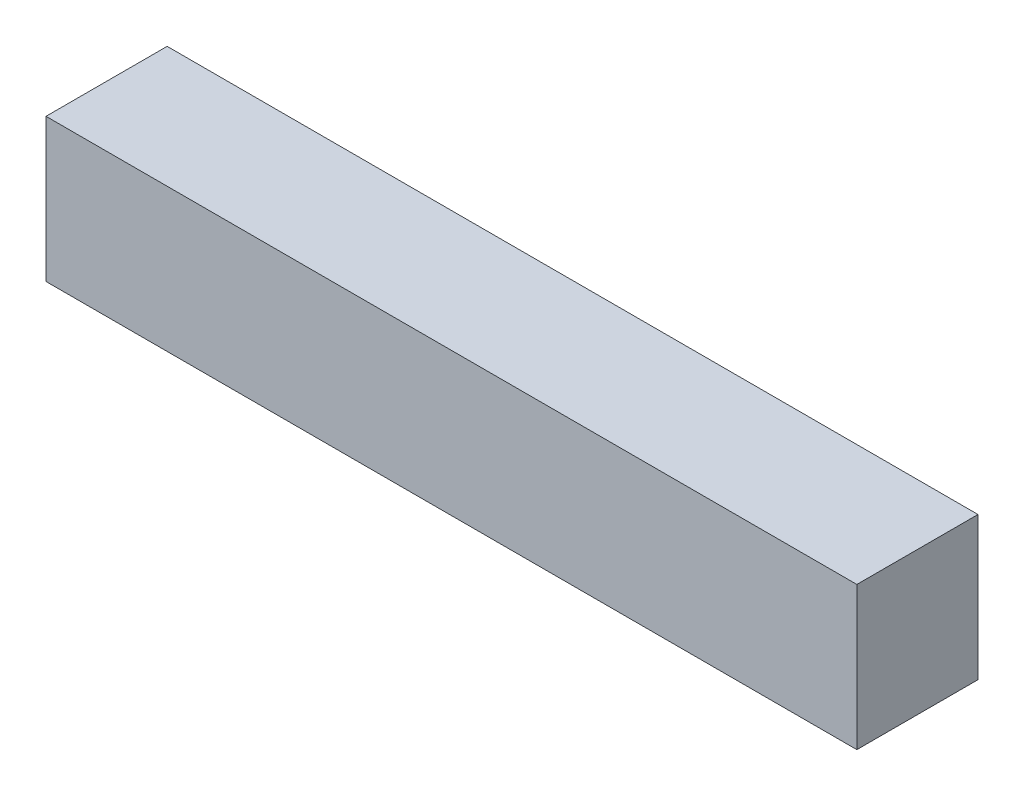
ISO-10303-21;
HEADER;
FILE_DESCRIPTION(('STEP AP214'),'2;1');
FILE_NAME('part.step','',(''),(''),'','','');
FILE_SCHEMA(('AUTOMOTIVE_DESIGN { 1 0 10303 214 1 1 1 1 }'));
ENDSEC;
DATA;
#1=APPLICATION_CONTEXT('core data for automotive mechanical design processes');
#2=APPLICATION_PROTOCOL_DEFINITION('international standard','automotive_design',2000,#1);
#3=PRODUCT_CONTEXT('',#1,'mechanical');
#4=PRODUCT('Part','Part','',(#3));
#5=PRODUCT_RELATED_PRODUCT_CATEGORY('part','',(#4));
#6=PRODUCT_DEFINITION_FORMATION('','',#4);
#7=PRODUCT_DEFINITION_CONTEXT('part definition',#1,'design');
#8=PRODUCT_DEFINITION('design','',#6,#7);
#9=PRODUCT_DEFINITION_SHAPE('','',#8);
#10=(LENGTH_UNIT() NAMED_UNIT(*) SI_UNIT(.MILLI.,.METRE.));
#11=(NAMED_UNIT(*) PLANE_ANGLE_UNIT() SI_UNIT($,.RADIAN.));
#12=(NAMED_UNIT(*) SI_UNIT($,.STERADIAN.) SOLID_ANGLE_UNIT());
#13=UNCERTAINTY_MEASURE_WITH_UNIT(LENGTH_MEASURE(1.E-05),#10,'distance_accuracy_value','');
#14=(GEOMETRIC_REPRESENTATION_CONTEXT(3) GLOBAL_UNCERTAINTY_ASSIGNED_CONTEXT((#13)) GLOBAL_UNIT_ASSIGNED_CONTEXT((#10,
#11,#12)) REPRESENTATION_CONTEXT('',''));
#15=CARTESIAN_POINT('',(0.,0.,0.));
#16=DIRECTION('',(0.,0.,1.));
#17=DIRECTION('',(1.,0.,0.));
#18=AXIS2_PLACEMENT_3D('',#15,#16,#17);
#19=CARTESIAN_POINT('',(-0.85000084,0.1499997,0.254));
#20=DIRECTION('',(0.,0.,-1.));
#21=DIRECTION('',(0.,-1.,0.));
#22=AXIS2_PLACEMENT_3D('',#19,#20,#21);
#23=PLANE('',#22);
#24=DIRECTION('',(0.,-1.,0.));
#25=VECTOR('',#24,1.);
#26=CARTESIAN_POINT('',(-0.85000084,0.1499997,0.254));
#27=LINE('',#26,#25);
#28=CARTESIAN_POINT('',(-0.85000084,0.1499997,0.254));
#29=VERTEX_POINT('',#28);
#30=CARTESIAN_POINT('',(-0.85000084,-0.1499997,0.254));
#31=VERTEX_POINT('',#30);
#32=EDGE_CURVE('E80',#29,#31,#27,.T.);
#33=ORIENTED_EDGE('',*,*,#32,.T.);
#34=DIRECTION('',(1.,0.,0.));
#35=VECTOR('',#34,1.);
#36=CARTESIAN_POINT('',(-0.85000084,-0.1499997,0.254));
#37=LINE('',#36,#35);
#38=CARTESIAN_POINT('',(0.8499983,-0.1499997,0.254));
#39=VERTEX_POINT('',#38);
#40=EDGE_CURVE('E90',#31,#39,#37,.T.);
#41=ORIENTED_EDGE('',*,*,#40,.T.);
#42=DIRECTION('',(0.,1.,0.));
#43=VECTOR('',#42,1.);
#44=CARTESIAN_POINT('',(0.8499983,-0.1499997,0.254));
#45=LINE('',#44,#43);
#46=CARTESIAN_POINT('',(0.8499983,0.1499997,0.254));
#47=VERTEX_POINT('',#46);
#48=EDGE_CURVE('E63',#39,#47,#45,.T.);
#49=ORIENTED_EDGE('',*,*,#48,.T.);
#50=DIRECTION('',(-1.,0.,0.));
#51=VECTOR('',#50,1.);
#52=CARTESIAN_POINT('',(0.8499983,0.1499997,0.254));
#53=LINE('',#52,#51);
#54=EDGE_CURVE('E11',#47,#29,#53,.T.);
#55=ORIENTED_EDGE('',*,*,#54,.T.);
#56=EDGE_LOOP('',(#33,#41,#49,#55));
#57=FACE_BOUND('',#56,.T.);
#58=ADVANCED_FACE('F17',(#57),#23,.F.);
#59=CARTESIAN_POINT('',(-0.85000084,0.1499997,0.));
#60=DIRECTION('',(0.,0.,-1.));
#61=DIRECTION('',(0.,-1.,0.));
#62=AXIS2_PLACEMENT_3D('',#59,#60,#61);
#63=PLANE('',#62);
#64=DIRECTION('',(0.,-1.,0.));
#65=VECTOR('',#64,1.);
#66=CARTESIAN_POINT('',(-0.85000084,0.1499997,0.));
#67=LINE('',#66,#65);
#68=CARTESIAN_POINT('',(-0.85000084,0.1499997,0.));
#69=VERTEX_POINT('',#68);
#70=CARTESIAN_POINT('',(-0.85000084,-0.1499997,0.));
#71=VERTEX_POINT('',#70);
#72=EDGE_CURVE('E67',#69,#71,#67,.T.);
#73=ORIENTED_EDGE('',*,*,#72,.F.);
#74=DIRECTION('',(-1.,0.,0.));
#75=VECTOR('',#74,1.);
#76=CARTESIAN_POINT('',(0.8499983,0.1499997,0.));
#77=LINE('',#76,#75);
#78=CARTESIAN_POINT('',(0.8499983,0.1499997,0.));
#79=VERTEX_POINT('',#78);
#80=EDGE_CURVE('E28',#79,#69,#77,.T.);
#81=ORIENTED_EDGE('',*,*,#80,.F.);
#82=DIRECTION('',(0.,1.,0.));
#83=VECTOR('',#82,1.);
#84=CARTESIAN_POINT('',(0.8499983,-0.1499997,0.));
#85=LINE('',#84,#83);
#86=CARTESIAN_POINT('',(0.8499983,-0.1499997,0.));
#87=VERTEX_POINT('',#86);
#88=EDGE_CURVE('E21',#87,#79,#85,.T.);
#89=ORIENTED_EDGE('',*,*,#88,.F.);
#90=DIRECTION('',(1.,0.,0.));
#91=VECTOR('',#90,1.);
#92=CARTESIAN_POINT('',(-0.85000084,-0.1499997,0.));
#93=LINE('',#92,#91);
#94=EDGE_CURVE('E70',#71,#87,#93,.T.);
#95=ORIENTED_EDGE('',*,*,#94,.F.);
#96=EDGE_LOOP('',(#73,#81,#89,#95));
#97=FACE_BOUND('',#96,.T.);
#98=ADVANCED_FACE('F68',(#97),#63,.T.);
#99=CARTESIAN_POINT('',(0.8499983,0.1499997,0.));
#100=DIRECTION('',(0.,-1.,0.));
#101=DIRECTION('',(0.,0.,-1.));
#102=AXIS2_PLACEMENT_3D('',#99,#100,#101);
#103=PLANE('',#102);
#104=DIRECTION('',(0.,0.,1.));
#105=VECTOR('',#104,1.);
#106=CARTESIAN_POINT('',(0.8499983,0.1499997,0.));
#107=LINE('',#106,#105);
#108=EDGE_CURVE('E58',#79,#47,#107,.T.);
#109=ORIENTED_EDGE('',*,*,#108,.F.);
#110=ORIENTED_EDGE('',*,*,#80,.T.);
#111=DIRECTION('',(0.,0.,1.));
#112=VECTOR('',#111,1.);
#113=CARTESIAN_POINT('',(-0.85000084,0.1499997,0.));
#114=LINE('',#113,#112);
#115=EDGE_CURVE('E56',#69,#29,#114,.T.);
#116=ORIENTED_EDGE('',*,*,#115,.T.);
#117=ORIENTED_EDGE('',*,*,#54,.F.);
#118=EDGE_LOOP('',(#109,#110,#116,#117));
#119=FACE_BOUND('',#118,.T.);
#120=ADVANCED_FACE('F54',(#119),#103,.F.);
#121=CARTESIAN_POINT('',(0.8499983,-0.1499997,0.));
#122=DIRECTION('',(-1.,0.,0.));
#123=DIRECTION('',(0.,0.,1.));
#124=AXIS2_PLACEMENT_3D('',#121,#122,#123);
#125=PLANE('',#124);
#126=DIRECTION('',(0.,0.,1.));
#127=VECTOR('',#126,1.);
#128=CARTESIAN_POINT('',(0.8499983,-0.1499997,0.));
#129=LINE('',#128,#127);
#130=EDGE_CURVE('E94',#87,#39,#129,.T.);
#131=ORIENTED_EDGE('',*,*,#130,.F.);
#132=ORIENTED_EDGE('',*,*,#88,.T.);
#133=ORIENTED_EDGE('',*,*,#108,.T.);
#134=ORIENTED_EDGE('',*,*,#48,.F.);
#135=EDGE_LOOP('',(#131,#132,#133,#134));
#136=FACE_BOUND('',#135,.T.);
#137=ADVANCED_FACE('F104',(#136),#125,.F.);
#138=CARTESIAN_POINT('',(-0.85000084,-0.1499997,0.));
#139=DIRECTION('',(0.,1.,0.));
#140=DIRECTION('',(1.,0.,0.));
#141=AXIS2_PLACEMENT_3D('',#138,#139,#140);
#142=PLANE('',#141);
#143=DIRECTION('',(0.,0.,1.));
#144=VECTOR('',#143,1.);
#145=CARTESIAN_POINT('',(-0.85000084,-0.1499997,0.));
#146=LINE('',#145,#144);
#147=EDGE_CURVE('E75',#71,#31,#146,.T.);
#148=ORIENTED_EDGE('',*,*,#147,.F.);
#149=ORIENTED_EDGE('',*,*,#94,.T.);
#150=ORIENTED_EDGE('',*,*,#130,.T.);
#151=ORIENTED_EDGE('',*,*,#40,.F.);
#152=EDGE_LOOP('',(#148,#149,#150,#151));
#153=FACE_BOUND('',#152,.T.);
#154=ADVANCED_FACE('F19',(#153),#142,.F.);
#155=CARTESIAN_POINT('',(-0.85000084,0.1499997,0.));
#156=DIRECTION('',(1.,0.,0.));
#157=DIRECTION('',(0.,1.,0.));
#158=AXIS2_PLACEMENT_3D('',#155,#156,#157);
#159=PLANE('',#158);
#160=ORIENTED_EDGE('',*,*,#115,.F.);
#161=ORIENTED_EDGE('',*,*,#72,.T.);
#162=ORIENTED_EDGE('',*,*,#147,.T.);
#163=ORIENTED_EDGE('',*,*,#32,.F.);
#164=EDGE_LOOP('',(#160,#161,#162,#163));
#165=FACE_BOUND('',#164,.T.);
#166=ADVANCED_FACE('F78',(#165),#159,.F.);
#167=CLOSED_SHELL('',(#58,#98,#120,#137,#154,#166));
#168=MANIFOLD_SOLID_BREP('B1',#167);
#169=ADVANCED_BREP_SHAPE_REPRESENTATION('',(#18,#168),#14);
#170=SHAPE_DEFINITION_REPRESENTATION(#9,#169);
ENDSEC;
END-ISO-10303-21;
